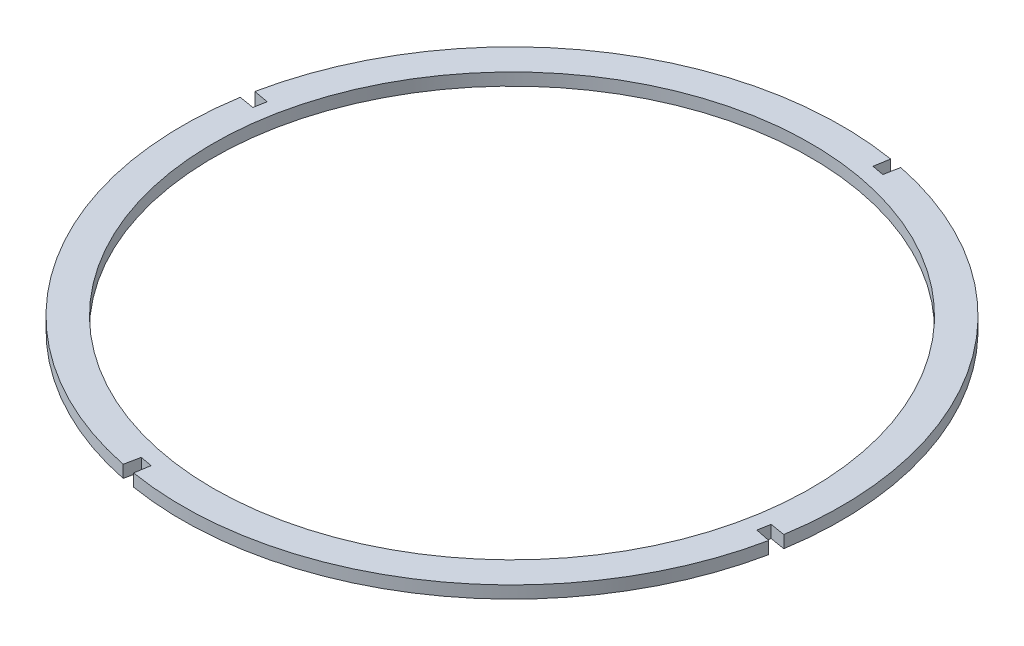
ISO-10303-21;
HEADER;
FILE_DESCRIPTION(('STEP AP214'),'2;1');
FILE_NAME('part.step','',(''),(''),'','','');
FILE_SCHEMA(('AUTOMOTIVE_DESIGN { 1 0 10303 214 1 1 1 1 }'));
ENDSEC;
DATA;
#1=APPLICATION_CONTEXT('core data for automotive mechanical design processes');
#2=APPLICATION_PROTOCOL_DEFINITION('international standard','automotive_design',2000,#1);
#3=PRODUCT_CONTEXT('',#1,'mechanical');
#4=PRODUCT('Part','Part','',(#3));
#5=PRODUCT_RELATED_PRODUCT_CATEGORY('part','',(#4));
#6=PRODUCT_DEFINITION_FORMATION('','',#4);
#7=PRODUCT_DEFINITION_CONTEXT('part definition',#1,'design');
#8=PRODUCT_DEFINITION('design','',#6,#7);
#9=PRODUCT_DEFINITION_SHAPE('','',#8);
#10=(LENGTH_UNIT() NAMED_UNIT(*) SI_UNIT(.MILLI.,.METRE.));
#11=(NAMED_UNIT(*) PLANE_ANGLE_UNIT() SI_UNIT($,.RADIAN.));
#12=(NAMED_UNIT(*) SI_UNIT($,.STERADIAN.) SOLID_ANGLE_UNIT());
#13=UNCERTAINTY_MEASURE_WITH_UNIT(LENGTH_MEASURE(1.E-05),#10,'distance_accuracy_value','');
#14=(GEOMETRIC_REPRESENTATION_CONTEXT(3) GLOBAL_UNCERTAINTY_ASSIGNED_CONTEXT((#13)) GLOBAL_UNIT_ASSIGNED_CONTEXT((#10,
#11,#12)) REPRESENTATION_CONTEXT('',''));
#15=CARTESIAN_POINT('',(0.,0.,0.));
#16=DIRECTION('',(0.,0.,1.));
#17=DIRECTION('',(1.,0.,0.));
#18=AXIS2_PLACEMENT_3D('',#15,#16,#17);
#19=CARTESIAN_POINT('',(-480.663059225891,16.,-187.275812916948));
#20=DIRECTION('',(0.,1.,0.));
#21=DIRECTION('',(0.,0.,1.));
#22=AXIS2_PLACEMENT_3D('',#19,#20,#21);
#23=PLANE('',#22);
#24=DIRECTION('',(0.162127293685163,0.,-0.986769851911946));
#25=VECTOR('',#24,1.);
#26=CARTESIAN_POINT('',(-414.416497784475,16.,-590.47818641838));
#27=LINE('',#26,#25);
#28=CARTESIAN_POINT('',(-414.416497784475,16.,-590.47818641838));
#29=VERTEX_POINT('',#28);
#30=CARTESIAN_POINT('',(-411.186650062988,16.,-610.136297556774));
#31=VERTEX_POINT('',#30);
#32=EDGE_CURVE('E242',#29,#31,#27,.T.);
#33=ORIENTED_EDGE('',*,*,#32,.T.);
#34=CARTESIAN_POINT('',(-480.663059225891,16.,-187.275812916948));
#35=DIRECTION('',(0.,1.,0.));
#36=DIRECTION('',(0.,0.,1.));
#37=AXIS2_PLACEMENT_3D('',#34,#35,#36);
#38=CIRCLE('',#37,428.53);
#39=CARTESIAN_POINT('',(-900.557467579152,16.,-272.871646540231));
#40=VERTEX_POINT('',#39);
#41=EDGE_CURVE('E130',#31,#40,#38,.T.);
#42=ORIENTED_EDGE('',*,*,#41,.T.);
#43=DIRECTION('',(0.983406473892087,0.,0.181415840287259));
#44=VECTOR('',#43,1.);
#45=CARTESIAN_POINT('',(-880.962779282727,16.,-269.256877940637));
#46=LINE('',#45,#44);
#47=CARTESIAN_POINT('',(-880.962779282727,16.,-269.256877940637));
#48=VERTEX_POINT('',#47);
#49=EDGE_CURVE('E295',#40,#48,#46,.T.);
#50=ORIENTED_EDGE('',*,*,#49,.T.);
#51=DIRECTION('',(-0.181415840287255,0.,0.983406473892088));
#52=VECTOR('',#51,1.);
#53=CARTESIAN_POINT('',(-880.962779282727,16.,-269.256877940637));
#54=LINE('',#53,#52);
#55=CARTESIAN_POINT('',(-883.865432727323,16.,-253.522374358363));
#56=VERTEX_POINT('',#55);
#57=EDGE_CURVE('E315',#48,#56,#54,.T.);
#58=ORIENTED_EDGE('',*,*,#57,.T.);
#59=DIRECTION('',(-0.986769851911947,0.,-0.162127293685162));
#60=VECTOR('',#59,1.);
#61=CARTESIAN_POINT('',(-883.865432727323,16.,-253.522374358363));
#62=LINE('',#61,#60);
#63=CARTESIAN_POINT('',(-903.523543865717,16.,-256.75222207985));
#64=VERTEX_POINT('',#63);
#65=EDGE_CURVE('E311',#56,#64,#62,.T.);
#66=ORIENTED_EDGE('',*,*,#65,.T.);
#67=CARTESIAN_POINT('',(-480.663059225891,16.,-187.275812916948));
#68=DIRECTION('',(0.,1.,0.));
#69=DIRECTION('',(0.,0.,1.));
#70=AXIS2_PLACEMENT_3D('',#67,#68,#69);
#71=CIRCLE('',#70,428.53);
#72=CARTESIAN_POINT('',(-566.39844235359,16.,232.59012399619));
#73=VERTEX_POINT('',#72);
#74=EDGE_CURVE('E314',#64,#73,#71,.T.);
#75=ORIENTED_EDGE('',*,*,#74,.T.);
#76=DIRECTION('',(0.200068567259458,0.,-0.979781898380832));
#77=VECTOR('',#76,1.);
#78=CARTESIAN_POINT('',(-562.412281663555,16.,213.06897611358));
#79=LINE('',#78,#77);
#80=CARTESIAN_POINT('',(-562.412281663555,16.,213.06897611358));
#81=VERTEX_POINT('',#80);
#82=EDGE_CURVE('E319',#73,#81,#79,.T.);
#83=ORIENTED_EDGE('',*,*,#82,.T.);
#84=DIRECTION('',(0.983458871104075,0.,0.18113157882241));
#85=VECTOR('',#84,1.);
#86=CARTESIAN_POINT('',(-562.412281663555,16.,213.06897611358));
#87=LINE('',#86,#85);
#88=CARTESIAN_POINT('',(-546.676939725889,16.,215.967081374738));
#89=VERTEX_POINT('',#88);
#90=EDGE_CURVE('E326',#81,#89,#87,.T.);
#91=ORIENTED_EDGE('',*,*,#90,.T.);
#92=DIRECTION('',(-0.161556925444141,0.,0.986863394721395));
#93=VECTOR('',#92,1.);
#94=CARTESIAN_POINT('',(-546.676939725889,16.,215.967081374738));
#95=LINE('',#94,#93);
#96=CARTESIAN_POINT('',(-549.895048486468,16.,235.624757623012));
#97=VERTEX_POINT('',#96);
#98=EDGE_CURVE('E329',#89,#97,#95,.T.);
#99=ORIENTED_EDGE('',*,*,#98,.T.);
#100=CARTESIAN_POINT('',(-480.663059225891,16.,-187.275812916948));
#101=DIRECTION('',(0.,1.,0.));
#102=DIRECTION('',(0.,0.,1.));
#103=AXIS2_PLACEMENT_3D('',#100,#101,#102);
#104=CIRCLE('',#103,428.53);
#105=CARTESIAN_POINT('',(-60.8467467511842,16.,-101.297765252794));
#106=VERTEX_POINT('',#105);
#107=EDGE_CURVE('E332',#97,#106,#104,.T.);
#108=ORIENTED_EDGE('',*,*,#107,.T.);
#109=DIRECTION('',(-0.979666096830342,0.,-0.200634839250821));
#110=VECTOR('',#109,1.);
#111=CARTESIAN_POINT('',(-80.3633391690542,16.,-105.294747893259));
#112=LINE('',#111,#110);
#113=CARTESIAN_POINT('',(-80.3633391690542,16.,-105.294747893259));
#114=VERTEX_POINT('',#113);
#115=EDGE_CURVE('E335',#106,#114,#112,.T.);
#116=ORIENTED_EDGE('',*,*,#115,.T.);
#117=DIRECTION('',(0.181415840287255,0.,-0.983406473892088));
#118=VECTOR('',#117,1.);
#119=CARTESIAN_POINT('',(-77.4606857244581,16.,-121.029251475532));
#120=LINE('',#119,#118);
#121=CARTESIAN_POINT('',(-77.4606857244581,16.,-121.029251475532));
#122=VERTEX_POINT('',#121);
#123=EDGE_CURVE('E338',#114,#122,#120,.T.);
#124=ORIENTED_EDGE('',*,*,#123,.T.);
#125=DIRECTION('',(0.986769851911946,0.,0.162127293685163));
#126=VECTOR('',#125,1.);
#127=CARTESIAN_POINT('',(-77.4606857244581,16.,-121.029251475532));
#128=LINE('',#127,#126);
#129=CARTESIAN_POINT('',(-57.8025745860642,16.,-117.799403754045));
#130=VERTEX_POINT('',#129);
#131=EDGE_CURVE('E173',#122,#130,#128,.T.);
#132=ORIENTED_EDGE('',*,*,#131,.T.);
#133=CARTESIAN_POINT('',(-480.663059225891,16.,-187.275812916948));
#134=DIRECTION('',(0.,1.,0.));
#135=DIRECTION('',(0.,0.,1.));
#136=AXIS2_PLACEMENT_3D('',#133,#134,#135);
#137=CIRCLE('',#136,428.53);
#138=CARTESIAN_POINT('',(-395.067225602608,16.,-607.170221270209));
#139=VERTEX_POINT('',#138);
#140=EDGE_CURVE('E167',#130,#139,#137,.T.);
#141=ORIENTED_EDGE('',*,*,#140,.T.);
#142=DIRECTION('',(-0.181415840287269,0.,0.983406473892085));
#143=VECTOR('',#142,1.);
#144=CARTESIAN_POINT('',(-398.681994202202,16.,-587.575532973784));
#145=LINE('',#144,#143);
#146=CARTESIAN_POINT('',(-398.681994202202,16.,-587.575532973784));
#147=VERTEX_POINT('',#146);
#148=EDGE_CURVE('E171',#139,#147,#145,.T.);
#149=ORIENTED_EDGE('',*,*,#148,.T.);
#150=DIRECTION('',(-0.983406473892088,0.,-0.181415840287254));
#151=VECTOR('',#150,1.);
#152=CARTESIAN_POINT('',(-414.416497784475,16.,-590.47818641838));
#153=LINE('',#152,#151);
#154=EDGE_CURVE('E63',#147,#29,#153,.T.);
#155=ORIENTED_EDGE('',*,*,#154,.T.);
#156=EDGE_LOOP('',(#33,#42,#50,#58,#66,#75,#83,#91,#99,#108,#116,#124,#132,#141,#149,#155));
#157=FACE_BOUND('',#156,.T.);
#158=CARTESIAN_POINT('',(-480.663059225891,16.,-187.275812916948));
#159=DIRECTION('',(0.,1.,0.));
#160=DIRECTION('',(0.,0.,1.));
#161=AXIS2_PLACEMENT_3D('',#158,#159,#160);
#162=CIRCLE('',#161,388.53);
#163=CARTESIAN_POINT('',(-480.663059225891,16.,201.254187083052));
#164=VERTEX_POINT('',#163);
#165=EDGE_CURVE('E200',#164,#164,#162,.T.);
#166=ORIENTED_EDGE('',*,*,#165,.F.);
#167=EDGE_LOOP('',(#166));
#168=FACE_BOUND('',#167,.T.);
#169=ADVANCED_FACE('F45',(#157,#168),#23,.T.);
#170=CARTESIAN_POINT('',(-480.663059225891,0.,-187.275812916948));
#171=DIRECTION('',(0.,1.,0.));
#172=DIRECTION('',(0.,0.,1.));
#173=AXIS2_PLACEMENT_3D('',#170,#171,#172);
#174=PLANE('',#173);
#175=DIRECTION('',(0.162127293685163,0.,-0.986769851911946));
#176=VECTOR('',#175,1.);
#177=CARTESIAN_POINT('',(-414.416497784475,0.,-590.47818641838));
#178=LINE('',#177,#176);
#179=CARTESIAN_POINT('',(-414.416497784475,0.,-590.47818641838));
#180=VERTEX_POINT('',#179);
#181=CARTESIAN_POINT('',(-411.186650062988,0.,-610.136297556774));
#182=VERTEX_POINT('',#181);
#183=EDGE_CURVE('E195',#180,#182,#178,.T.);
#184=ORIENTED_EDGE('',*,*,#183,.F.);
#185=DIRECTION('',(-0.983406473892088,0.,-0.181415840287254));
#186=VECTOR('',#185,1.);
#187=CARTESIAN_POINT('',(-414.416497784475,0.,-590.47818641838));
#188=LINE('',#187,#186);
#189=CARTESIAN_POINT('',(-398.681994202202,0.,-587.575532973784));
#190=VERTEX_POINT('',#189);
#191=EDGE_CURVE('E122',#190,#180,#188,.T.);
#192=ORIENTED_EDGE('',*,*,#191,.F.);
#193=DIRECTION('',(-0.181415840287269,0.,0.983406473892085));
#194=VECTOR('',#193,1.);
#195=CARTESIAN_POINT('',(-398.681994202202,0.,-587.575532973784));
#196=LINE('',#195,#194);
#197=CARTESIAN_POINT('',(-395.067225602608,0.,-607.170221270209));
#198=VERTEX_POINT('',#197);
#199=EDGE_CURVE('E116',#198,#190,#196,.T.);
#200=ORIENTED_EDGE('',*,*,#199,.F.);
#201=CARTESIAN_POINT('',(-480.663059225891,0.,-187.275812916948));
#202=DIRECTION('',(0.,1.,0.));
#203=DIRECTION('',(0.,0.,1.));
#204=AXIS2_PLACEMENT_3D('',#201,#202,#203);
#205=CIRCLE('',#204,428.53);
#206=CARTESIAN_POINT('',(-57.8025745860642,0.,-117.799403754045));
#207=VERTEX_POINT('',#206);
#208=EDGE_CURVE('E182',#207,#198,#205,.T.);
#209=ORIENTED_EDGE('',*,*,#208,.F.);
#210=DIRECTION('',(0.986769851911946,0.,0.162127293685163));
#211=VECTOR('',#210,1.);
#212=CARTESIAN_POINT('',(-77.4606857244581,0.,-121.029251475532));
#213=LINE('',#212,#211);
#214=CARTESIAN_POINT('',(-77.4606857244581,0.,-121.029251475532));
#215=VERTEX_POINT('',#214);
#216=EDGE_CURVE('E233',#215,#207,#213,.T.);
#217=ORIENTED_EDGE('',*,*,#216,.F.);
#218=DIRECTION('',(0.181415840287255,0.,-0.983406473892088));
#219=VECTOR('',#218,1.);
#220=CARTESIAN_POINT('',(-77.4606857244581,0.,-121.029251475532));
#221=LINE('',#220,#219);
#222=CARTESIAN_POINT('',(-80.3633391690542,0.,-105.294747893259));
#223=VERTEX_POINT('',#222);
#224=EDGE_CURVE('E230',#223,#215,#221,.T.);
#225=ORIENTED_EDGE('',*,*,#224,.F.);
#226=DIRECTION('',(-0.979666096830342,0.,-0.200634839250821));
#227=VECTOR('',#226,1.);
#228=CARTESIAN_POINT('',(-80.3633391690542,0.,-105.294747893259));
#229=LINE('',#228,#227);
#230=CARTESIAN_POINT('',(-60.8467467511842,0.,-101.297765252794));
#231=VERTEX_POINT('',#230);
#232=EDGE_CURVE('E227',#231,#223,#229,.T.);
#233=ORIENTED_EDGE('',*,*,#232,.F.);
#234=CARTESIAN_POINT('',(-480.663059225891,0.,-187.275812916948));
#235=DIRECTION('',(0.,1.,0.));
#236=DIRECTION('',(0.,0.,1.));
#237=AXIS2_PLACEMENT_3D('',#234,#235,#236);
#238=CIRCLE('',#237,428.53);
#239=CARTESIAN_POINT('',(-549.895048486468,0.,235.624757623012));
#240=VERTEX_POINT('',#239);
#241=EDGE_CURVE('E224',#240,#231,#238,.T.);
#242=ORIENTED_EDGE('',*,*,#241,.F.);
#243=DIRECTION('',(-0.161556925444141,0.,0.986863394721395));
#244=VECTOR('',#243,1.);
#245=CARTESIAN_POINT('',(-546.676939725889,0.,215.967081374738));
#246=LINE('',#245,#244);
#247=CARTESIAN_POINT('',(-546.676939725889,0.,215.967081374738));
#248=VERTEX_POINT('',#247);
#249=EDGE_CURVE('E221',#248,#240,#246,.T.);
#250=ORIENTED_EDGE('',*,*,#249,.F.);
#251=DIRECTION('',(0.983458871104075,0.,0.18113157882241));
#252=VECTOR('',#251,1.);
#253=CARTESIAN_POINT('',(-562.412281663555,0.,213.06897611358));
#254=LINE('',#253,#252);
#255=CARTESIAN_POINT('',(-562.412281663555,0.,213.06897611358));
#256=VERTEX_POINT('',#255);
#257=EDGE_CURVE('E218',#256,#248,#254,.T.);
#258=ORIENTED_EDGE('',*,*,#257,.F.);
#259=DIRECTION('',(0.200068567259458,0.,-0.979781898380832));
#260=VECTOR('',#259,1.);
#261=CARTESIAN_POINT('',(-562.412281663555,0.,213.06897611358));
#262=LINE('',#261,#260);
#263=CARTESIAN_POINT('',(-566.39844235359,0.,232.59012399619));
#264=VERTEX_POINT('',#263);
#265=EDGE_CURVE('E215',#264,#256,#262,.T.);
#266=ORIENTED_EDGE('',*,*,#265,.F.);
#267=CARTESIAN_POINT('',(-480.663059225891,0.,-187.275812916948));
#268=DIRECTION('',(0.,1.,0.));
#269=DIRECTION('',(0.,0.,1.));
#270=AXIS2_PLACEMENT_3D('',#267,#268,#269);
#271=CIRCLE('',#270,428.53);
#272=CARTESIAN_POINT('',(-903.523543865717,0.,-256.75222207985));
#273=VERTEX_POINT('',#272);
#274=EDGE_CURVE('E212',#273,#264,#271,.T.);
#275=ORIENTED_EDGE('',*,*,#274,.F.);
#276=DIRECTION('',(-0.986769851911947,0.,-0.162127293685162));
#277=VECTOR('',#276,1.);
#278=CARTESIAN_POINT('',(-883.865432727323,0.,-253.522374358363));
#279=LINE('',#278,#277);
#280=CARTESIAN_POINT('',(-883.865432727323,0.,-253.522374358363));
#281=VERTEX_POINT('',#280);
#282=EDGE_CURVE('E209',#281,#273,#279,.T.);
#283=ORIENTED_EDGE('',*,*,#282,.F.);
#284=DIRECTION('',(-0.181415840287255,0.,0.983406473892088));
#285=VECTOR('',#284,1.);
#286=CARTESIAN_POINT('',(-880.962779282727,0.,-269.256877940637));
#287=LINE('',#286,#285);
#288=CARTESIAN_POINT('',(-880.962779282727,0.,-269.256877940637));
#289=VERTEX_POINT('',#288);
#290=EDGE_CURVE('E206',#289,#281,#287,.T.);
#291=ORIENTED_EDGE('',*,*,#290,.F.);
#292=DIRECTION('',(0.983406473892087,0.,0.181415840287259));
#293=VECTOR('',#292,1.);
#294=CARTESIAN_POINT('',(-880.962779282727,0.,-269.256877940637));
#295=LINE('',#294,#293);
#296=CARTESIAN_POINT('',(-900.557467579152,0.,-272.871646540231));
#297=VERTEX_POINT('',#296);
#298=EDGE_CURVE('E203',#297,#289,#295,.T.);
#299=ORIENTED_EDGE('',*,*,#298,.F.);
#300=CARTESIAN_POINT('',(-480.663059225891,0.,-187.275812916948));
#301=DIRECTION('',(0.,1.,0.));
#302=DIRECTION('',(0.,0.,1.));
#303=AXIS2_PLACEMENT_3D('',#300,#301,#302);
#304=CIRCLE('',#303,428.53);
#305=EDGE_CURVE('E199',#182,#297,#304,.T.);
#306=ORIENTED_EDGE('',*,*,#305,.F.);
#307=EDGE_LOOP('',(#184,#192,#200,#209,#217,#225,#233,#242,#250,#258,#266,#275,#283,#291,#299,#306));
#308=FACE_BOUND('',#307,.T.);
#309=CARTESIAN_POINT('',(-480.663059225891,0.,-187.275812916948));
#310=DIRECTION('',(0.,1.,0.));
#311=DIRECTION('',(0.,0.,1.));
#312=AXIS2_PLACEMENT_3D('',#309,#310,#311);
#313=CIRCLE('',#312,388.53);
#314=CARTESIAN_POINT('',(-480.663059225891,0.,201.254187083052));
#315=VERTEX_POINT('',#314);
#316=EDGE_CURVE('E539',#315,#315,#313,.T.);
#317=ORIENTED_EDGE('',*,*,#316,.T.);
#318=EDGE_LOOP('',(#317));
#319=FACE_BOUND('',#318,.T.);
#320=ADVANCED_FACE('F299',(#308,#319),#174,.F.);
#321=CARTESIAN_POINT('',(-414.416497784475,16.,-590.47818641838));
#322=DIRECTION('',(-0.986769851911947,0.,-0.162127293685163));
#323=DIRECTION('',(-0.162127293685163,0.,0.986769851911947));
#324=AXIS2_PLACEMENT_3D('',#321,#322,#323);
#325=PLANE('',#324);
#326=ORIENTED_EDGE('',*,*,#183,.T.);
#327=DIRECTION('',(0.,-1.,0.));
#328=VECTOR('',#327,1.);
#329=CARTESIAN_POINT('',(-411.186650062988,16.,-610.136297556774));
#330=LINE('',#329,#328);
#331=EDGE_CURVE('E11',#31,#182,#330,.T.);
#332=ORIENTED_EDGE('',*,*,#331,.F.);
#333=ORIENTED_EDGE('',*,*,#32,.F.);
#334=DIRECTION('',(0.,-1.,0.));
#335=VECTOR('',#334,1.);
#336=CARTESIAN_POINT('',(-414.416497784475,16.,-590.47818641838));
#337=LINE('',#336,#335);
#338=EDGE_CURVE('E191',#29,#180,#337,.T.);
#339=ORIENTED_EDGE('',*,*,#338,.T.);
#340=EDGE_LOOP('',(#326,#332,#333,#339));
#341=FACE_BOUND('',#340,.T.);
#342=ADVANCED_FACE('F47',(#341),#325,.F.);
#343=CARTESIAN_POINT('',(-480.663059225891,16.,-187.275812916948));
#344=DIRECTION('',(0.,-1.,0.));
#345=DIRECTION('',(0.,0.,-1.));
#346=AXIS2_PLACEMENT_3D('',#343,#344,#345);
#347=CYLINDRICAL_SURFACE('',#346,428.53);
#348=ORIENTED_EDGE('',*,*,#305,.T.);
#349=DIRECTION('',(0.,-1.,0.));
#350=VECTOR('',#349,1.);
#351=CARTESIAN_POINT('',(-900.557467579152,16.,-272.871646540231));
#352=LINE('',#351,#350);
#353=EDGE_CURVE('E55',#40,#297,#352,.T.);
#354=ORIENTED_EDGE('',*,*,#353,.F.);
#355=ORIENTED_EDGE('',*,*,#41,.F.);
#356=ORIENTED_EDGE('',*,*,#331,.T.);
#357=EDGE_LOOP('',(#348,#354,#355,#356));
#358=FACE_BOUND('',#357,.T.);
#359=ADVANCED_FACE('F374',(#358),#347,.T.);
#360=CARTESIAN_POINT('',(-880.962779282727,16.,-269.256877940637));
#361=DIRECTION('',(0.181415840287259,0.,-0.983406473892087));
#362=DIRECTION('',(-0.983406473892087,0.,-0.181415840287259));
#363=AXIS2_PLACEMENT_3D('',#360,#361,#362);
#364=PLANE('',#363);
#365=ORIENTED_EDGE('',*,*,#298,.T.);
#366=DIRECTION('',(0.,-1.,0.));
#367=VECTOR('',#366,1.);
#368=CARTESIAN_POINT('',(-880.962779282727,16.,-269.256877940637));
#369=LINE('',#368,#367);
#370=EDGE_CURVE('E285',#48,#289,#369,.T.);
#371=ORIENTED_EDGE('',*,*,#370,.F.);
#372=ORIENTED_EDGE('',*,*,#49,.F.);
#373=ORIENTED_EDGE('',*,*,#353,.T.);
#374=EDGE_LOOP('',(#365,#371,#372,#373));
#375=FACE_BOUND('',#374,.T.);
#376=ADVANCED_FACE('F293',(#375),#364,.F.);
#377=CARTESIAN_POINT('',(-880.962779282727,16.,-269.256877940637));
#378=DIRECTION('',(0.983406473892088,0.,0.181415840287255));
#379=DIRECTION('',(0.181415840287255,0.,-0.983406473892088));
#380=AXIS2_PLACEMENT_3D('',#377,#378,#379);
#381=PLANE('',#380);
#382=ORIENTED_EDGE('',*,*,#290,.T.);
#383=DIRECTION('',(0.,-1.,0.));
#384=VECTOR('',#383,1.);
#385=CARTESIAN_POINT('',(-883.865432727323,16.,-253.522374358363));
#386=LINE('',#385,#384);
#387=EDGE_CURVE('E281',#56,#281,#386,.T.);
#388=ORIENTED_EDGE('',*,*,#387,.F.);
#389=ORIENTED_EDGE('',*,*,#57,.F.);
#390=ORIENTED_EDGE('',*,*,#370,.T.);
#391=EDGE_LOOP('',(#382,#388,#389,#390));
#392=FACE_BOUND('',#391,.T.);
#393=ADVANCED_FACE('F305',(#392),#381,.F.);
#394=CARTESIAN_POINT('',(-883.865432727323,16.,-253.522374358363));
#395=DIRECTION('',(-0.162127293685162,0.,0.986769851911947));
#396=DIRECTION('',(0.986769851911947,0.,0.162127293685162));
#397=AXIS2_PLACEMENT_3D('',#394,#395,#396);
#398=PLANE('',#397);
#399=ORIENTED_EDGE('',*,*,#282,.T.);
#400=DIRECTION('',(0.,-1.,0.));
#401=VECTOR('',#400,1.);
#402=CARTESIAN_POINT('',(-903.523543865717,16.,-256.75222207985));
#403=LINE('',#402,#401);
#404=EDGE_CURVE('E277',#64,#273,#403,.T.);
#405=ORIENTED_EDGE('',*,*,#404,.F.);
#406=ORIENTED_EDGE('',*,*,#65,.F.);
#407=ORIENTED_EDGE('',*,*,#387,.T.);
#408=EDGE_LOOP('',(#399,#405,#406,#407));
#409=FACE_BOUND('',#408,.T.);
#410=ADVANCED_FACE('F309',(#409),#398,.F.);
#411=CARTESIAN_POINT('',(-480.663059225891,16.,-187.275812916948));
#412=DIRECTION('',(0.,-1.,0.));
#413=DIRECTION('',(0.,0.,-1.));
#414=AXIS2_PLACEMENT_3D('',#411,#412,#413);
#415=CYLINDRICAL_SURFACE('',#414,428.53);
#416=ORIENTED_EDGE('',*,*,#274,.T.);
#417=DIRECTION('',(0.,-1.,0.));
#418=VECTOR('',#417,1.);
#419=CARTESIAN_POINT('',(-566.39844235359,16.,232.59012399619));
#420=LINE('',#419,#418);
#421=EDGE_CURVE('E273',#73,#264,#420,.T.);
#422=ORIENTED_EDGE('',*,*,#421,.F.);
#423=ORIENTED_EDGE('',*,*,#74,.F.);
#424=ORIENTED_EDGE('',*,*,#404,.T.);
#425=EDGE_LOOP('',(#416,#422,#423,#424));
#426=FACE_BOUND('',#425,.T.);
#427=ADVANCED_FACE('F387',(#426),#415,.T.);
#428=CARTESIAN_POINT('',(-562.412281663555,16.,213.06897611358));
#429=DIRECTION('',(-0.979781898380833,0.,-0.200068567259458));
#430=DIRECTION('',(-0.200068567259458,0.,0.979781898380833));
#431=AXIS2_PLACEMENT_3D('',#428,#429,#430);
#432=PLANE('',#431);
#433=ORIENTED_EDGE('',*,*,#265,.T.);
#434=DIRECTION('',(0.,-1.,0.));
#435=VECTOR('',#434,1.);
#436=CARTESIAN_POINT('',(-562.412281663555,16.,213.06897611358));
#437=LINE('',#436,#435);
#438=EDGE_CURVE('E269',#81,#256,#437,.T.);
#439=ORIENTED_EDGE('',*,*,#438,.F.);
#440=ORIENTED_EDGE('',*,*,#82,.F.);
#441=ORIENTED_EDGE('',*,*,#421,.T.);
#442=EDGE_LOOP('',(#433,#439,#440,#441));
#443=FACE_BOUND('',#442,.T.);
#444=ADVANCED_FACE('F390',(#443),#432,.F.);
#445=CARTESIAN_POINT('',(-562.412281663555,16.,213.06897611358));
#446=DIRECTION('',(0.18113157882241,0.,-0.983458871104075));
#447=DIRECTION('',(-0.983458871104075,0.,-0.18113157882241));
#448=AXIS2_PLACEMENT_3D('',#445,#446,#447);
#449=PLANE('',#448);
#450=ORIENTED_EDGE('',*,*,#257,.T.);
#451=DIRECTION('',(0.,-1.,0.));
#452=VECTOR('',#451,1.);
#453=CARTESIAN_POINT('',(-546.676939725889,16.,215.967081374738));
#454=LINE('',#453,#452);
#455=EDGE_CURVE('E265',#89,#248,#454,.T.);
#456=ORIENTED_EDGE('',*,*,#455,.F.);
#457=ORIENTED_EDGE('',*,*,#90,.F.);
#458=ORIENTED_EDGE('',*,*,#438,.T.);
#459=EDGE_LOOP('',(#450,#456,#457,#458));
#460=FACE_BOUND('',#459,.T.);
#461=ADVANCED_FACE('F394',(#460),#449,.F.);
#462=CARTESIAN_POINT('',(-546.676939725889,16.,215.967081374738));
#463=DIRECTION('',(0.986863394721395,0.,0.161556925444141));
#464=DIRECTION('',(0.161556925444141,0.,-0.986863394721395));
#465=AXIS2_PLACEMENT_3D('',#462,#463,#464);
#466=PLANE('',#465);
#467=ORIENTED_EDGE('',*,*,#249,.T.);
#468=DIRECTION('',(0.,-1.,0.));
#469=VECTOR('',#468,1.);
#470=CARTESIAN_POINT('',(-549.895048486468,16.,235.624757623012));
#471=LINE('',#470,#469);
#472=EDGE_CURVE('E261',#97,#240,#471,.T.);
#473=ORIENTED_EDGE('',*,*,#472,.F.);
#474=ORIENTED_EDGE('',*,*,#98,.F.);
#475=ORIENTED_EDGE('',*,*,#455,.T.);
#476=EDGE_LOOP('',(#467,#473,#474,#475));
#477=FACE_BOUND('',#476,.T.);
#478=ADVANCED_FACE('F398',(#477),#466,.F.);
#479=CARTESIAN_POINT('',(-480.663059225891,16.,-187.275812916948));
#480=DIRECTION('',(0.,-1.,0.));
#481=DIRECTION('',(0.,0.,-1.));
#482=AXIS2_PLACEMENT_3D('',#479,#480,#481);
#483=CYLINDRICAL_SURFACE('',#482,428.53);
#484=ORIENTED_EDGE('',*,*,#241,.T.);
#485=DIRECTION('',(0.,-1.,0.));
#486=VECTOR('',#485,1.);
#487=CARTESIAN_POINT('',(-60.8467467511842,16.,-101.297765252794));
#488=LINE('',#487,#486);
#489=EDGE_CURVE('E257',#106,#231,#488,.T.);
#490=ORIENTED_EDGE('',*,*,#489,.F.);
#491=ORIENTED_EDGE('',*,*,#107,.F.);
#492=ORIENTED_EDGE('',*,*,#472,.T.);
#493=EDGE_LOOP('',(#484,#490,#491,#492));
#494=FACE_BOUND('',#493,.T.);
#495=ADVANCED_FACE('F402',(#494),#483,.T.);
#496=CARTESIAN_POINT('',(-80.3633391690542,16.,-105.294747893259));
#497=DIRECTION('',(-0.200634839250821,0.,0.979666096830342));
#498=DIRECTION('',(0.979666096830342,0.,0.200634839250821));
#499=AXIS2_PLACEMENT_3D('',#496,#497,#498);
#500=PLANE('',#499);
#501=ORIENTED_EDGE('',*,*,#232,.T.);
#502=DIRECTION('',(0.,-1.,0.));
#503=VECTOR('',#502,1.);
#504=CARTESIAN_POINT('',(-80.3633391690542,16.,-105.294747893259));
#505=LINE('',#504,#503);
#506=EDGE_CURVE('E253',#114,#223,#505,.T.);
#507=ORIENTED_EDGE('',*,*,#506,.F.);
#508=ORIENTED_EDGE('',*,*,#115,.F.);
#509=ORIENTED_EDGE('',*,*,#489,.T.);
#510=EDGE_LOOP('',(#501,#507,#508,#509));
#511=FACE_BOUND('',#510,.T.);
#512=ADVANCED_FACE('F406',(#511),#500,.F.);
#513=CARTESIAN_POINT('',(-77.4606857244581,16.,-121.029251475532));
#514=DIRECTION('',(-0.983406473892088,0.,-0.181415840287255));
#515=DIRECTION('',(-0.181415840287255,0.,0.983406473892088));
#516=AXIS2_PLACEMENT_3D('',#513,#514,#515);
#517=PLANE('',#516);
#518=ORIENTED_EDGE('',*,*,#224,.T.);
#519=DIRECTION('',(0.,-1.,0.));
#520=VECTOR('',#519,1.);
#521=CARTESIAN_POINT('',(-77.4606857244581,16.,-121.029251475532));
#522=LINE('',#521,#520);
#523=EDGE_CURVE('E249',#122,#215,#522,.T.);
#524=ORIENTED_EDGE('',*,*,#523,.F.);
#525=ORIENTED_EDGE('',*,*,#123,.F.);
#526=ORIENTED_EDGE('',*,*,#506,.T.);
#527=EDGE_LOOP('',(#518,#524,#525,#526));
#528=FACE_BOUND('',#527,.T.);
#529=ADVANCED_FACE('F346',(#528),#517,.F.);
#530=CARTESIAN_POINT('',(-77.4606857244581,16.,-121.029251475532));
#531=DIRECTION('',(0.162127293685163,0.,-0.986769851911947));
#532=DIRECTION('',(-0.986769851911947,0.,-0.162127293685163));
#533=AXIS2_PLACEMENT_3D('',#530,#531,#532);
#534=PLANE('',#533);
#535=ORIENTED_EDGE('',*,*,#216,.T.);
#536=DIRECTION('',(0.,-1.,0.));
#537=VECTOR('',#536,1.);
#538=CARTESIAN_POINT('',(-57.8025745860642,16.,-117.799403754045));
#539=LINE('',#538,#537);
#540=EDGE_CURVE('E184',#130,#207,#539,.T.);
#541=ORIENTED_EDGE('',*,*,#540,.F.);
#542=ORIENTED_EDGE('',*,*,#131,.F.);
#543=ORIENTED_EDGE('',*,*,#523,.T.);
#544=EDGE_LOOP('',(#535,#541,#542,#543));
#545=FACE_BOUND('',#544,.T.);
#546=ADVANCED_FACE('F350',(#545),#534,.F.);
#547=CARTESIAN_POINT('',(-480.663059225891,16.,-187.275812916948));
#548=DIRECTION('',(0.,-1.,0.));
#549=DIRECTION('',(0.,0.,-1.));
#550=AXIS2_PLACEMENT_3D('',#547,#548,#549);
#551=CYLINDRICAL_SURFACE('',#550,428.53);
#552=ORIENTED_EDGE('',*,*,#208,.T.);
#553=DIRECTION('',(0.,-1.,0.));
#554=VECTOR('',#553,1.);
#555=CARTESIAN_POINT('',(-395.067225602608,16.,-607.170221270209));
#556=LINE('',#555,#554);
#557=EDGE_CURVE('E179',#139,#198,#556,.T.);
#558=ORIENTED_EDGE('',*,*,#557,.F.);
#559=ORIENTED_EDGE('',*,*,#140,.F.);
#560=ORIENTED_EDGE('',*,*,#540,.T.);
#561=EDGE_LOOP('',(#552,#558,#559,#560));
#562=FACE_BOUND('',#561,.T.);
#563=ADVANCED_FACE('F180',(#562),#551,.T.);
#564=CARTESIAN_POINT('',(-398.681994202202,16.,-587.575532973784));
#565=DIRECTION('',(0.983406473892085,0.,0.181415840287269));
#566=DIRECTION('',(0.181415840287269,0.,-0.983406473892085));
#567=AXIS2_PLACEMENT_3D('',#564,#565,#566);
#568=PLANE('',#567);
#569=ORIENTED_EDGE('',*,*,#199,.T.);
#570=DIRECTION('',(0.,-1.,0.));
#571=VECTOR('',#570,1.);
#572=CARTESIAN_POINT('',(-398.681994202202,16.,-587.575532973784));
#573=LINE('',#572,#571);
#574=EDGE_CURVE('E185',#147,#190,#573,.T.);
#575=ORIENTED_EDGE('',*,*,#574,.F.);
#576=ORIENTED_EDGE('',*,*,#148,.F.);
#577=ORIENTED_EDGE('',*,*,#557,.T.);
#578=EDGE_LOOP('',(#569,#575,#576,#577));
#579=FACE_BOUND('',#578,.T.);
#580=ADVANCED_FACE('F187',(#579),#568,.F.);
#581=CARTESIAN_POINT('',(-414.416497784475,16.,-590.47818641838));
#582=DIRECTION('',(-0.181415840287254,0.,0.983406473892088));
#583=DIRECTION('',(0.983406473892088,0.,0.181415840287254));
#584=AXIS2_PLACEMENT_3D('',#581,#582,#583);
#585=PLANE('',#584);
#586=ORIENTED_EDGE('',*,*,#191,.T.);
#587=ORIENTED_EDGE('',*,*,#338,.F.);
#588=ORIENTED_EDGE('',*,*,#154,.F.);
#589=ORIENTED_EDGE('',*,*,#574,.T.);
#590=EDGE_LOOP('',(#586,#587,#588,#589));
#591=FACE_BOUND('',#590,.T.);
#592=ADVANCED_FACE('F354',(#591),#585,.F.);
#593=CARTESIAN_POINT('',(-480.663059225891,16.,-187.275812916948));
#594=DIRECTION('',(0.,-1.,0.));
#595=DIRECTION('',(0.,0.,-1.));
#596=AXIS2_PLACEMENT_3D('',#593,#594,#595);
#597=CYLINDRICAL_SURFACE('',#596,388.53);
#598=ORIENTED_EDGE('',*,*,#165,.T.);
#599=EDGE_LOOP('',(#598));
#600=FACE_BOUND('',#599,.T.);
#601=ORIENTED_EDGE('',*,*,#316,.F.);
#602=EDGE_LOOP('',(#601));
#603=FACE_BOUND('',#602,.T.);
#604=ADVANCED_FACE('F356',(#600,#603),#597,.F.);
#605=CLOSED_SHELL('',(#169,#320,#342,#359,#376,#393,#410,#427,#444,#461,#478,#495,#512,#529,
#546,#563,#580,#592,#604));
#606=MANIFOLD_SOLID_BREP('B2',#605);
#607=ADVANCED_BREP_SHAPE_REPRESENTATION('',(#18,#606),#14);
#608=SHAPE_DEFINITION_REPRESENTATION(#9,#607);
ENDSEC;
END-ISO-10303-21;
